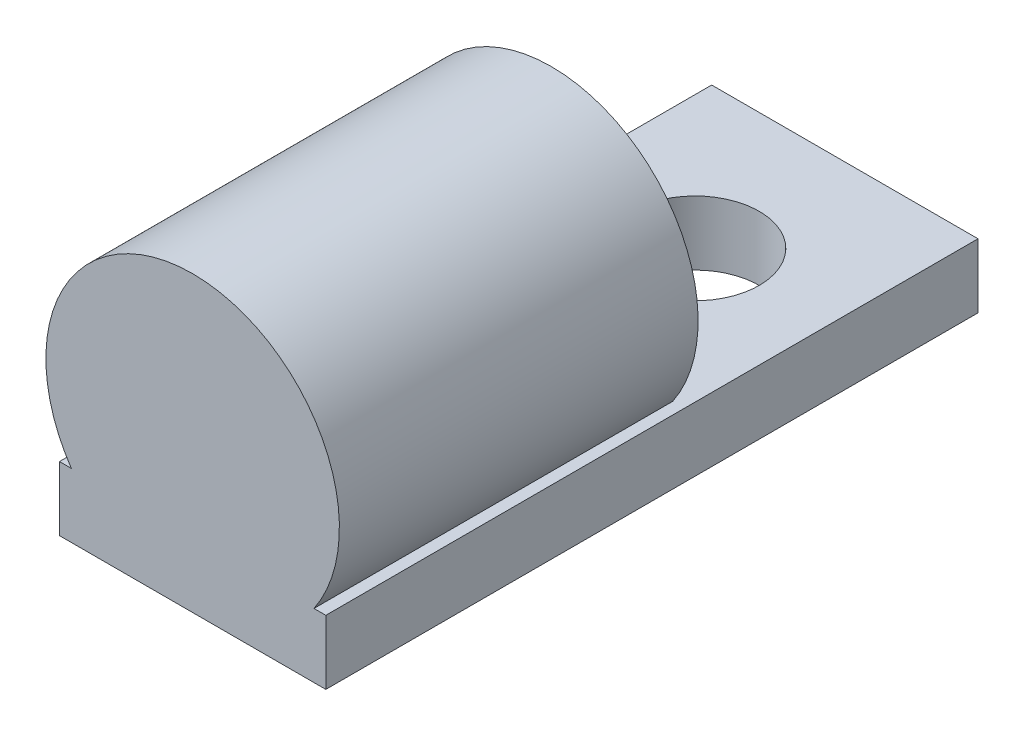
ISO-10303-21;
HEADER;
FILE_DESCRIPTION(('STEP AP214'),'2;1');
FILE_NAME('part.step','',(''),(''),'','','');
FILE_SCHEMA(('AUTOMOTIVE_DESIGN { 1 0 10303 214 1 1 1 1 }'));
ENDSEC;
DATA;
#1=APPLICATION_CONTEXT('core data for automotive mechanical design processes');
#2=APPLICATION_PROTOCOL_DEFINITION('international standard','automotive_design',2000,#1);
#3=PRODUCT_CONTEXT('',#1,'mechanical');
#4=PRODUCT('Part','Part','',(#3));
#5=PRODUCT_RELATED_PRODUCT_CATEGORY('part','',(#4));
#6=PRODUCT_DEFINITION_FORMATION('','',#4);
#7=PRODUCT_DEFINITION_CONTEXT('part definition',#1,'design');
#8=PRODUCT_DEFINITION('design','',#6,#7);
#9=PRODUCT_DEFINITION_SHAPE('','',#8);
#10=(LENGTH_UNIT() NAMED_UNIT(*) SI_UNIT(.MILLI.,.METRE.));
#11=(NAMED_UNIT(*) PLANE_ANGLE_UNIT() SI_UNIT($,.RADIAN.));
#12=(NAMED_UNIT(*) SI_UNIT($,.STERADIAN.) SOLID_ANGLE_UNIT());
#13=UNCERTAINTY_MEASURE_WITH_UNIT(LENGTH_MEASURE(1.E-05),#10,'distance_accuracy_value','');
#14=(GEOMETRIC_REPRESENTATION_CONTEXT(3) GLOBAL_UNCERTAINTY_ASSIGNED_CONTEXT((#13)) GLOBAL_UNIT_ASSIGNED_CONTEXT((#10,
#11,#12)) REPRESENTATION_CONTEXT('',''));
#15=CARTESIAN_POINT('',(0.,0.,0.));
#16=DIRECTION('',(0.,0.,1.));
#17=DIRECTION('',(1.,0.,0.));
#18=AXIS2_PLACEMENT_3D('',#15,#16,#17);
#19=CARTESIAN_POINT('',(0.,3.,0.));
#20=DIRECTION('',(0.,1.,0.));
#21=DIRECTION('',(0.,0.,1.));
#22=AXIS2_PLACEMENT_3D('',#19,#20,#21);
#23=PLANE('',#22);
#24=DIRECTION('',(0.,0.,1.));
#25=VECTOR('',#24,1.);
#26=CARTESIAN_POINT('',(-5.66992063436518,3.,-1.524));
#27=LINE('',#26,#25);
#28=CARTESIAN_POINT('',(-5.66992063436518,3.,-1.524));
#29=VERTEX_POINT('',#28);
#30=CARTESIAN_POINT('',(-5.66992063436518,3.,15.24));
#31=VERTEX_POINT('',#30);
#32=EDGE_CURVE('E53',#29,#31,#27,.T.);
#33=ORIENTED_EDGE('',*,*,#32,.F.);
#34=DIRECTION('',(1.,0.,0.));
#35=VECTOR('',#34,1.);
#36=CARTESIAN_POINT('',(0.,3.,-1.524));
#37=LINE('',#36,#35);
#38=CARTESIAN_POINT('',(5.66992063436518,3.,-1.524));
#39=VERTEX_POINT('',#38);
#40=EDGE_CURVE('E48',#29,#39,#37,.T.);
#41=ORIENTED_EDGE('',*,*,#40,.T.);
#42=DIRECTION('',(0.,0.,1.));
#43=VECTOR('',#42,1.);
#44=CARTESIAN_POINT('',(5.66992063436518,3.,-1.524));
#45=LINE('',#44,#43);
#46=CARTESIAN_POINT('',(5.66992063436518,3.,15.24));
#47=VERTEX_POINT('',#46);
#48=EDGE_CURVE('E97',#47,#39,#45,.F.);
#49=ORIENTED_EDGE('',*,*,#48,.F.);
#50=DIRECTION('',(1.,0.,0.));
#51=VECTOR('',#50,1.);
#52=CARTESIAN_POINT('',(-6.223,3.,15.24));
#53=LINE('',#52,#51);
#54=CARTESIAN_POINT('',(6.223,3.,15.24));
#55=VERTEX_POINT('',#54);
#56=EDGE_CURVE('E85',#47,#55,#53,.T.);
#57=ORIENTED_EDGE('',*,*,#56,.T.);
#58=DIRECTION('',(0.,0.,-1.));
#59=VECTOR('',#58,1.);
#60=CARTESIAN_POINT('',(6.223,3.,-15.24));
#61=LINE('',#60,#59);
#62=CARTESIAN_POINT('',(6.223,3.,-15.24));
#63=VERTEX_POINT('',#62);
#64=EDGE_CURVE('E117',#55,#63,#61,.T.);
#65=ORIENTED_EDGE('',*,*,#64,.T.);
#66=DIRECTION('',(-1.,0.,0.));
#67=VECTOR('',#66,1.);
#68=CARTESIAN_POINT('',(-6.223,3.,-15.24));
#69=LINE('',#68,#67);
#70=CARTESIAN_POINT('',(-6.223,3.,-15.24));
#71=VERTEX_POINT('',#70);
#72=EDGE_CURVE('E119',#63,#71,#69,.T.);
#73=ORIENTED_EDGE('',*,*,#72,.T.);
#74=DIRECTION('',(0.,0.,1.));
#75=VECTOR('',#74,1.);
#76=CARTESIAN_POINT('',(-6.223,3.,-15.24));
#77=LINE('',#76,#75);
#78=CARTESIAN_POINT('',(-6.223,3.,15.24));
#79=VERTEX_POINT('',#78);
#80=EDGE_CURVE('E95',#71,#79,#77,.T.);
#81=ORIENTED_EDGE('',*,*,#80,.T.);
#82=EDGE_CURVE('E94',#79,#31,#53,.T.);
#83=ORIENTED_EDGE('',*,*,#82,.T.);
#84=EDGE_LOOP('',(#33,#41,#49,#57,#65,#73,#81,#83));
#85=FACE_BOUND('',#84,.T.);
#86=CARTESIAN_POINT('',(0.,3.,-8.24));
#87=DIRECTION('',(0.,1.,0.));
#88=DIRECTION('',(0.,0.,1.));
#89=AXIS2_PLACEMENT_3D('',#86,#87,#88);
#90=CIRCLE('',#89,3.);
#91=CARTESIAN_POINT('',(0.,3.,-5.24));
#92=VERTEX_POINT('',#91);
#93=EDGE_CURVE('E111',#92,#92,#90,.T.);
#94=ORIENTED_EDGE('',*,*,#93,.F.);
#95=EDGE_LOOP('',(#94));
#96=FACE_BOUND('',#95,.T.);
#97=ADVANCED_FACE('F33',(#85,#96),#23,.T.);
#98=CARTESIAN_POINT('',(0.,0.,0.));
#99=DIRECTION('',(0.,1.,0.));
#100=DIRECTION('',(0.,0.,1.));
#101=AXIS2_PLACEMENT_3D('',#98,#99,#100);
#102=PLANE('',#101);
#103=DIRECTION('',(0.,0.,-1.));
#104=VECTOR('',#103,1.);
#105=CARTESIAN_POINT('',(6.223,0.,-15.24));
#106=LINE('',#105,#104);
#107=CARTESIAN_POINT('',(6.223,0.,15.24));
#108=VERTEX_POINT('',#107);
#109=CARTESIAN_POINT('',(6.223,0.,-15.24));
#110=VERTEX_POINT('',#109);
#111=EDGE_CURVE('E114',#108,#110,#106,.T.);
#112=ORIENTED_EDGE('',*,*,#111,.F.);
#113=DIRECTION('',(1.,0.,0.));
#114=VECTOR('',#113,1.);
#115=CARTESIAN_POINT('',(-6.223,0.,15.24));
#116=LINE('',#115,#114);
#117=CARTESIAN_POINT('',(-6.223,0.,15.24));
#118=VERTEX_POINT('',#117);
#119=EDGE_CURVE('E120',#118,#108,#116,.T.);
#120=ORIENTED_EDGE('',*,*,#119,.F.);
#121=DIRECTION('',(0.,0.,1.));
#122=VECTOR('',#121,1.);
#123=CARTESIAN_POINT('',(-6.223,0.,-15.24));
#124=LINE('',#123,#122);
#125=CARTESIAN_POINT('',(-6.223,0.,-15.24));
#126=VERTEX_POINT('',#125);
#127=EDGE_CURVE('E127',#126,#118,#124,.T.);
#128=ORIENTED_EDGE('',*,*,#127,.F.);
#129=DIRECTION('',(-1.,0.,0.));
#130=VECTOR('',#129,1.);
#131=CARTESIAN_POINT('',(-6.223,0.,-15.24));
#132=LINE('',#131,#130);
#133=EDGE_CURVE('E125',#110,#126,#132,.T.);
#134=ORIENTED_EDGE('',*,*,#133,.F.);
#135=EDGE_LOOP('',(#112,#120,#128,#134));
#136=FACE_BOUND('',#135,.T.);
#137=CARTESIAN_POINT('',(0.,0.,-8.24));
#138=DIRECTION('',(0.,1.,0.));
#139=DIRECTION('',(0.,0.,1.));
#140=AXIS2_PLACEMENT_3D('',#137,#138,#139);
#141=CIRCLE('',#140,3.);
#142=CARTESIAN_POINT('',(0.,0.,-5.24));
#143=VERTEX_POINT('',#142);
#144=EDGE_CURVE('E110',#143,#143,#141,.T.);
#145=ORIENTED_EDGE('',*,*,#144,.T.);
#146=EDGE_LOOP('',(#145));
#147=FACE_BOUND('',#146,.T.);
#148=ADVANCED_FACE('F144',(#136,#147),#102,.F.);
#149=CARTESIAN_POINT('',(6.223,3.,-15.24));
#150=DIRECTION('',(-1.,0.,0.));
#151=DIRECTION('',(0.,0.,1.));
#152=AXIS2_PLACEMENT_3D('',#149,#150,#151);
#153=PLANE('',#152);
#154=ORIENTED_EDGE('',*,*,#111,.T.);
#155=DIRECTION('',(0.,-1.,0.));
#156=VECTOR('',#155,1.);
#157=CARTESIAN_POINT('',(6.223,3.,-15.24));
#158=LINE('',#157,#156);
#159=EDGE_CURVE('E11',#63,#110,#158,.T.);
#160=ORIENTED_EDGE('',*,*,#159,.F.);
#161=ORIENTED_EDGE('',*,*,#64,.F.);
#162=DIRECTION('',(0.,-1.,0.));
#163=VECTOR('',#162,1.);
#164=CARTESIAN_POINT('',(6.223,3.,15.24));
#165=LINE('',#164,#163);
#166=EDGE_CURVE('E91',#55,#108,#165,.T.);
#167=ORIENTED_EDGE('',*,*,#166,.T.);
#168=EDGE_LOOP('',(#154,#160,#161,#167));
#169=FACE_BOUND('',#168,.T.);
#170=ADVANCED_FACE('F35',(#169),#153,.F.);
#171=CARTESIAN_POINT('',(-6.223,3.,-15.24));
#172=DIRECTION('',(0.,0.,1.));
#173=DIRECTION('',(1.,0.,0.));
#174=AXIS2_PLACEMENT_3D('',#171,#172,#173);
#175=PLANE('',#174);
#176=ORIENTED_EDGE('',*,*,#133,.T.);
#177=DIRECTION('',(0.,-1.,0.));
#178=VECTOR('',#177,1.);
#179=CARTESIAN_POINT('',(-6.223,3.,-15.24));
#180=LINE('',#179,#178);
#181=EDGE_CURVE('E41',#71,#126,#180,.T.);
#182=ORIENTED_EDGE('',*,*,#181,.F.);
#183=ORIENTED_EDGE('',*,*,#72,.F.);
#184=ORIENTED_EDGE('',*,*,#159,.T.);
#185=EDGE_LOOP('',(#176,#182,#183,#184));
#186=FACE_BOUND('',#185,.T.);
#187=ADVANCED_FACE('F148',(#186),#175,.F.);
#188=CARTESIAN_POINT('',(-6.223,3.,-15.24));
#189=DIRECTION('',(1.,0.,0.));
#190=DIRECTION('',(0.,0.,-1.));
#191=AXIS2_PLACEMENT_3D('',#188,#189,#190);
#192=PLANE('',#191);
#193=ORIENTED_EDGE('',*,*,#127,.T.);
#194=DIRECTION('',(0.,-1.,0.));
#195=VECTOR('',#194,1.);
#196=CARTESIAN_POINT('',(-6.223,3.,15.24));
#197=LINE('',#196,#195);
#198=EDGE_CURVE('E131',#79,#118,#197,.T.);
#199=ORIENTED_EDGE('',*,*,#198,.F.);
#200=ORIENTED_EDGE('',*,*,#80,.F.);
#201=ORIENTED_EDGE('',*,*,#181,.T.);
#202=EDGE_LOOP('',(#193,#199,#200,#201));
#203=FACE_BOUND('',#202,.T.);
#204=ADVANCED_FACE('F138',(#203),#192,.F.);
#205=CARTESIAN_POINT('',(-6.223,3.,15.24));
#206=DIRECTION('',(0.,0.,-1.));
#207=DIRECTION('',(-1.,0.,0.));
#208=AXIS2_PLACEMENT_3D('',#205,#206,#207);
#209=PLANE('',#208);
#210=ORIENTED_EDGE('',*,*,#119,.T.);
#211=ORIENTED_EDGE('',*,*,#166,.F.);
#212=ORIENTED_EDGE('',*,*,#56,.F.);
#213=CARTESIAN_POINT('',(0.,6.858,15.24));
#214=DIRECTION('',(0.,0.,1.));
#215=DIRECTION('',(1.,0.,0.));
#216=AXIS2_PLACEMENT_3D('',#213,#214,#215);
#217=CIRCLE('',#216,6.858);
#218=EDGE_CURVE('E89',#47,#31,#217,.T.);
#219=ORIENTED_EDGE('',*,*,#218,.T.);
#220=ORIENTED_EDGE('',*,*,#82,.F.);
#221=ORIENTED_EDGE('',*,*,#198,.T.);
#222=EDGE_LOOP('',(#210,#211,#212,#219,#220,#221));
#223=FACE_BOUND('',#222,.T.);
#224=ADVANCED_FACE('F86',(#223),#209,.F.);
#225=CARTESIAN_POINT('',(0.,3.,-8.24));
#226=DIRECTION('',(0.,-1.,0.));
#227=DIRECTION('',(0.,0.,-1.));
#228=AXIS2_PLACEMENT_3D('',#225,#226,#227);
#229=CYLINDRICAL_SURFACE('',#228,3.);
#230=ORIENTED_EDGE('',*,*,#93,.T.);
#231=EDGE_LOOP('',(#230));
#232=FACE_BOUND('',#231,.T.);
#233=ORIENTED_EDGE('',*,*,#144,.F.);
#234=EDGE_LOOP('',(#233));
#235=FACE_BOUND('',#234,.T.);
#236=ADVANCED_FACE('F162',(#232,#235),#229,.F.);
#237=CARTESIAN_POINT('',(0.,6.858,-1.524));
#238=DIRECTION('',(0.,0.,1.));
#239=DIRECTION('',(1.,0.,0.));
#240=AXIS2_PLACEMENT_3D('',#237,#238,#239);
#241=CYLINDRICAL_SURFACE('',#240,6.858);
#242=CARTESIAN_POINT('',(0.,6.858,-1.524));
#243=DIRECTION('',(0.,0.,1.));
#244=DIRECTION('',(1.,0.,0.));
#245=AXIS2_PLACEMENT_3D('',#242,#243,#244);
#246=CIRCLE('',#245,6.858);
#247=EDGE_CURVE('E102',#39,#29,#246,.T.);
#248=ORIENTED_EDGE('',*,*,#247,.T.);
#249=ORIENTED_EDGE('',*,*,#32,.T.);
#250=ORIENTED_EDGE('',*,*,#218,.F.);
#251=ORIENTED_EDGE('',*,*,#48,.T.);
#252=EDGE_LOOP('',(#248,#249,#250,#251));
#253=FACE_BOUND('',#252,.T.);
#254=ADVANCED_FACE('F104',(#253),#241,.T.);
#255=CARTESIAN_POINT('',(0.,6.858,-1.524));
#256=DIRECTION('',(0.,0.,1.));
#257=DIRECTION('',(1.,0.,0.));
#258=AXIS2_PLACEMENT_3D('',#255,#256,#257);
#259=PLANE('',#258);
#260=ORIENTED_EDGE('',*,*,#40,.F.);
#261=ORIENTED_EDGE('',*,*,#247,.F.);
#262=EDGE_LOOP('',(#260,#261));
#263=FACE_BOUND('',#262,.T.);
#264=ADVANCED_FACE('F173',(#263),#259,.F.);
#265=CLOSED_SHELL('',(#97,#148,#170,#187,#204,#224,#236,#254,#264));
#266=MANIFOLD_SOLID_BREP('B2',#265);
#267=ADVANCED_BREP_SHAPE_REPRESENTATION('',(#18,#266),#14);
#268=SHAPE_DEFINITION_REPRESENTATION(#9,#267);
ENDSEC;
END-ISO-10303-21;
